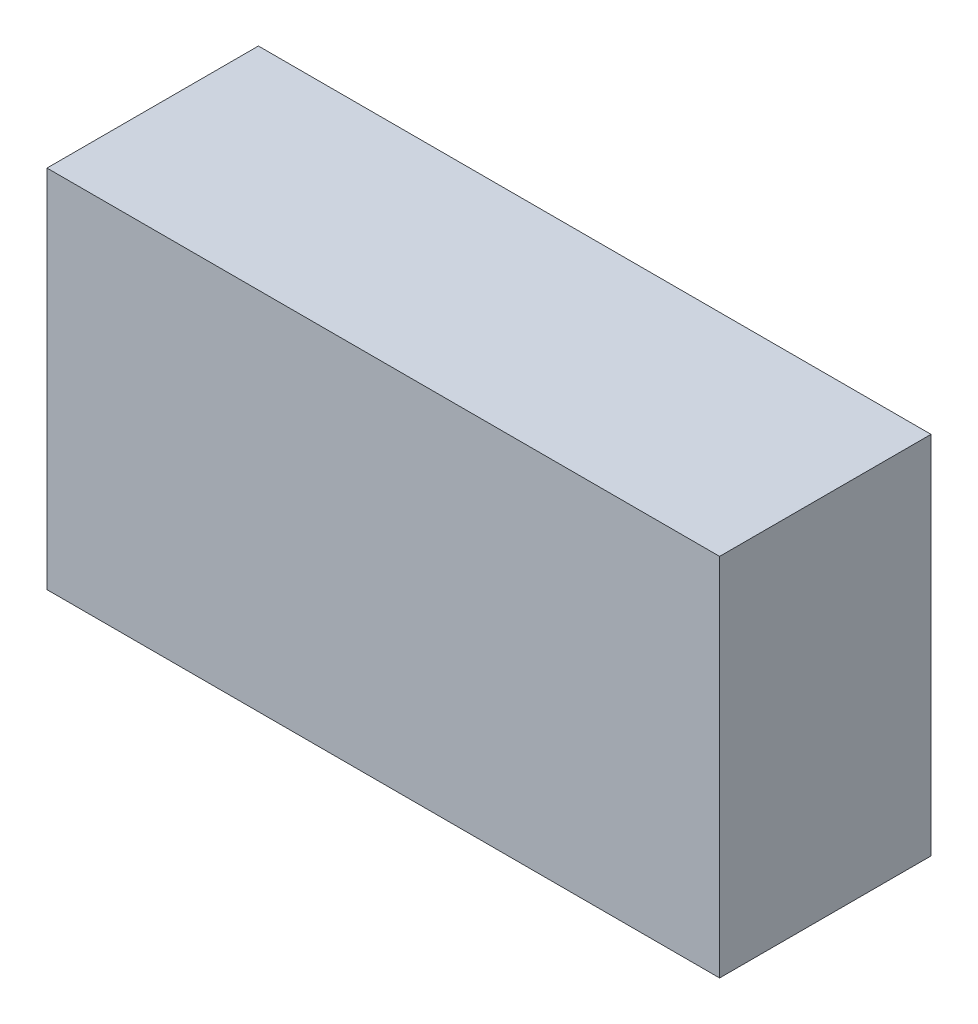
ISO-10303-21;
HEADER;
FILE_DESCRIPTION(('STEP AP214'),'2;1');
FILE_NAME('part.step','',(''),(''),'','','');
FILE_SCHEMA(('AUTOMOTIVE_DESIGN { 1 0 10303 214 1 1 1 1 }'));
ENDSEC;
DATA;
#1=APPLICATION_CONTEXT('core data for automotive mechanical design processes');
#2=APPLICATION_PROTOCOL_DEFINITION('international standard','automotive_design',2000,#1);
#3=PRODUCT_CONTEXT('',#1,'mechanical');
#4=PRODUCT('Part','Part','',(#3));
#5=PRODUCT_RELATED_PRODUCT_CATEGORY('part','',(#4));
#6=PRODUCT_DEFINITION_FORMATION('','',#4);
#7=PRODUCT_DEFINITION_CONTEXT('part definition',#1,'design');
#8=PRODUCT_DEFINITION('design','',#6,#7);
#9=PRODUCT_DEFINITION_SHAPE('','',#8);
#10=(LENGTH_UNIT() NAMED_UNIT(*) SI_UNIT(.MILLI.,.METRE.));
#11=(NAMED_UNIT(*) PLANE_ANGLE_UNIT() SI_UNIT($,.RADIAN.));
#12=(NAMED_UNIT(*) SI_UNIT($,.STERADIAN.) SOLID_ANGLE_UNIT());
#13=UNCERTAINTY_MEASURE_WITH_UNIT(LENGTH_MEASURE(1.E-05),#10,'distance_accuracy_value','');
#14=(GEOMETRIC_REPRESENTATION_CONTEXT(3) GLOBAL_UNCERTAINTY_ASSIGNED_CONTEXT((#13)) GLOBAL_UNIT_ASSIGNED_CONTEXT((#10,
#11,#12)) REPRESENTATION_CONTEXT('',''));
#15=CARTESIAN_POINT('',(0.,0.,0.));
#16=DIRECTION('',(0.,0.,1.));
#17=DIRECTION('',(1.,0.,0.));
#18=AXIS2_PLACEMENT_3D('',#15,#16,#17);
#19=CARTESIAN_POINT('',(0.87499952,0.47500032,0.5499989));
#20=DIRECTION('',(0.,0.,-1.));
#21=DIRECTION('',(-1.,0.,0.));
#22=AXIS2_PLACEMENT_3D('',#19,#20,#21);
#23=PLANE('',#22);
#24=DIRECTION('',(0.,1.,0.));
#25=VECTOR('',#24,1.);
#26=CARTESIAN_POINT('',(-0.87499952,0.47500032,0.5499989));
#27=LINE('',#26,#25);
#28=CARTESIAN_POINT('',(-0.87499952,0.47500032,0.5499989));
#29=VERTEX_POINT('',#28);
#30=CARTESIAN_POINT('',(-0.87499952,-0.47500032,0.5499989));
#31=VERTEX_POINT('',#30);
#32=EDGE_CURVE('E54',#29,#31,#27,.F.);
#33=ORIENTED_EDGE('',*,*,#32,.T.);
#34=DIRECTION('',(1.,0.,0.));
#35=VECTOR('',#34,1.);
#36=CARTESIAN_POINT('',(-0.87499952,-0.47500032,0.5499989));
#37=LINE('',#36,#35);
#38=CARTESIAN_POINT('',(0.87499952,-0.47500032,0.5499989));
#39=VERTEX_POINT('',#38);
#40=EDGE_CURVE('E56',#31,#39,#37,.T.);
#41=ORIENTED_EDGE('',*,*,#40,.T.);
#42=DIRECTION('',(0.,1.,0.));
#43=VECTOR('',#42,1.);
#44=CARTESIAN_POINT('',(0.87499952,-0.47500032,0.5499989));
#45=LINE('',#44,#43);
#46=CARTESIAN_POINT('',(0.87499952,0.47500032,0.5499989));
#47=VERTEX_POINT('',#46);
#48=EDGE_CURVE('E19',#39,#47,#45,.T.);
#49=ORIENTED_EDGE('',*,*,#48,.T.);
#50=DIRECTION('',(1.,0.,0.));
#51=VECTOR('',#50,1.);
#52=CARTESIAN_POINT('',(0.87499952,0.47500032,0.5499989));
#53=LINE('',#52,#51);
#54=EDGE_CURVE('E79',#47,#29,#53,.F.);
#55=ORIENTED_EDGE('',*,*,#54,.T.);
#56=EDGE_LOOP('',(#33,#41,#49,#55));
#57=FACE_BOUND('',#56,.T.);
#58=ADVANCED_FACE('F16',(#57),#23,.F.);
#59=CARTESIAN_POINT('',(0.87499952,-0.47500032,0.));
#60=DIRECTION('',(-1.,0.,0.));
#61=DIRECTION('',(0.,0.,1.));
#62=AXIS2_PLACEMENT_3D('',#59,#60,#61);
#63=PLANE('',#62);
#64=DIRECTION('',(0.,0.,-1.));
#65=VECTOR('',#64,1.);
#66=CARTESIAN_POINT('',(0.87499952,0.47500032,0.));
#67=LINE('',#66,#65);
#68=CARTESIAN_POINT('',(0.87499952,0.47500032,0.));
#69=VERTEX_POINT('',#68);
#70=EDGE_CURVE('E67',#69,#47,#67,.F.);
#71=ORIENTED_EDGE('',*,*,#70,.T.);
#72=ORIENTED_EDGE('',*,*,#48,.F.);
#73=DIRECTION('',(0.,0.,1.));
#74=VECTOR('',#73,1.);
#75=CARTESIAN_POINT('',(0.87499952,-0.47500032,0.));
#76=LINE('',#75,#74);
#77=CARTESIAN_POINT('',(0.87499952,-0.47500032,0.));
#78=VERTEX_POINT('',#77);
#79=EDGE_CURVE('E62',#39,#78,#76,.F.);
#80=ORIENTED_EDGE('',*,*,#79,.T.);
#81=DIRECTION('',(0.,1.,0.));
#82=VECTOR('',#81,1.);
#83=CARTESIAN_POINT('',(0.87499952,0.47500032,0.));
#84=LINE('',#83,#82);
#85=EDGE_CURVE('E82',#69,#78,#84,.F.);
#86=ORIENTED_EDGE('',*,*,#85,.F.);
#87=EDGE_LOOP('',(#71,#72,#80,#86));
#88=FACE_BOUND('',#87,.T.);
#89=ADVANCED_FACE('F64',(#88),#63,.F.);
#90=CARTESIAN_POINT('',(-0.87499952,-0.47500032,0.));
#91=DIRECTION('',(0.,1.,0.));
#92=DIRECTION('',(0.,0.,1.));
#93=AXIS2_PLACEMENT_3D('',#90,#91,#92);
#94=PLANE('',#93);
#95=ORIENTED_EDGE('',*,*,#79,.F.);
#96=ORIENTED_EDGE('',*,*,#40,.F.);
#97=DIRECTION('',(0.,0.,-1.));
#98=VECTOR('',#97,1.);
#99=CARTESIAN_POINT('',(-0.87499952,-0.47500032,0.));
#100=LINE('',#99,#98);
#101=CARTESIAN_POINT('',(-0.87499952,-0.47500032,0.));
#102=VERTEX_POINT('',#101);
#103=EDGE_CURVE('E74',#31,#102,#100,.T.);
#104=ORIENTED_EDGE('',*,*,#103,.T.);
#105=DIRECTION('',(-1.,0.,0.));
#106=VECTOR('',#105,1.);
#107=CARTESIAN_POINT('',(0.87499952,-0.47500032,0.));
#108=LINE('',#107,#106);
#109=EDGE_CURVE('E71',#78,#102,#108,.T.);
#110=ORIENTED_EDGE('',*,*,#109,.F.);
#111=EDGE_LOOP('',(#95,#96,#104,#110));
#112=FACE_BOUND('',#111,.T.);
#113=ADVANCED_FACE('F69',(#112),#94,.F.);
#114=CARTESIAN_POINT('',(-0.87499952,0.47500032,0.));
#115=DIRECTION('',(1.,0.,0.));
#116=DIRECTION('',(0.,0.,-1.));
#117=AXIS2_PLACEMENT_3D('',#114,#115,#116);
#118=PLANE('',#117);
#119=ORIENTED_EDGE('',*,*,#103,.F.);
#120=ORIENTED_EDGE('',*,*,#32,.F.);
#121=DIRECTION('',(0.,0.,-1.));
#122=VECTOR('',#121,1.);
#123=CARTESIAN_POINT('',(-0.87499952,0.47500032,0.));
#124=LINE('',#123,#122);
#125=CARTESIAN_POINT('',(-0.87499952,0.47500032,0.));
#126=VERTEX_POINT('',#125);
#127=EDGE_CURVE('E34',#29,#126,#124,.T.);
#128=ORIENTED_EDGE('',*,*,#127,.T.);
#129=DIRECTION('',(0.,1.,0.));
#130=VECTOR('',#129,1.);
#131=CARTESIAN_POINT('',(-0.87499952,0.47500032,0.));
#132=LINE('',#131,#130);
#133=EDGE_CURVE('E25',#102,#126,#132,.T.);
#134=ORIENTED_EDGE('',*,*,#133,.F.);
#135=EDGE_LOOP('',(#119,#120,#128,#134));
#136=FACE_BOUND('',#135,.T.);
#137=ADVANCED_FACE('F88',(#136),#118,.F.);
#138=CARTESIAN_POINT('',(0.87499952,0.47500032,0.));
#139=DIRECTION('',(0.,-1.,0.));
#140=DIRECTION('',(0.,0.,-1.));
#141=AXIS2_PLACEMENT_3D('',#138,#139,#140);
#142=PLANE('',#141);
#143=ORIENTED_EDGE('',*,*,#127,.F.);
#144=ORIENTED_EDGE('',*,*,#54,.F.);
#145=ORIENTED_EDGE('',*,*,#70,.F.);
#146=DIRECTION('',(-1.,0.,0.));
#147=VECTOR('',#146,1.);
#148=CARTESIAN_POINT('',(0.87499952,0.47500032,0.));
#149=LINE('',#148,#147);
#150=EDGE_CURVE('E11',#126,#69,#149,.F.);
#151=ORIENTED_EDGE('',*,*,#150,.F.);
#152=EDGE_LOOP('',(#143,#144,#145,#151));
#153=FACE_BOUND('',#152,.T.);
#154=ADVANCED_FACE('F90',(#153),#142,.F.);
#155=CARTESIAN_POINT('',(0.87499952,0.47500032,0.));
#156=DIRECTION('',(0.,0.,-1.));
#157=DIRECTION('',(-1.,0.,0.));
#158=AXIS2_PLACEMENT_3D('',#155,#156,#157);
#159=PLANE('',#158);
#160=ORIENTED_EDGE('',*,*,#133,.T.);
#161=ORIENTED_EDGE('',*,*,#150,.T.);
#162=ORIENTED_EDGE('',*,*,#85,.T.);
#163=ORIENTED_EDGE('',*,*,#109,.T.);
#164=EDGE_LOOP('',(#160,#161,#162,#163));
#165=FACE_BOUND('',#164,.T.);
#166=ADVANCED_FACE('F87',(#165),#159,.T.);
#167=CLOSED_SHELL('',(#58,#89,#113,#137,#154,#166));
#168=MANIFOLD_SOLID_BREP('B1',#167);
#169=ADVANCED_BREP_SHAPE_REPRESENTATION('',(#18,#168),#14);
#170=SHAPE_DEFINITION_REPRESENTATION(#9,#169);
ENDSEC;
END-ISO-10303-21;
